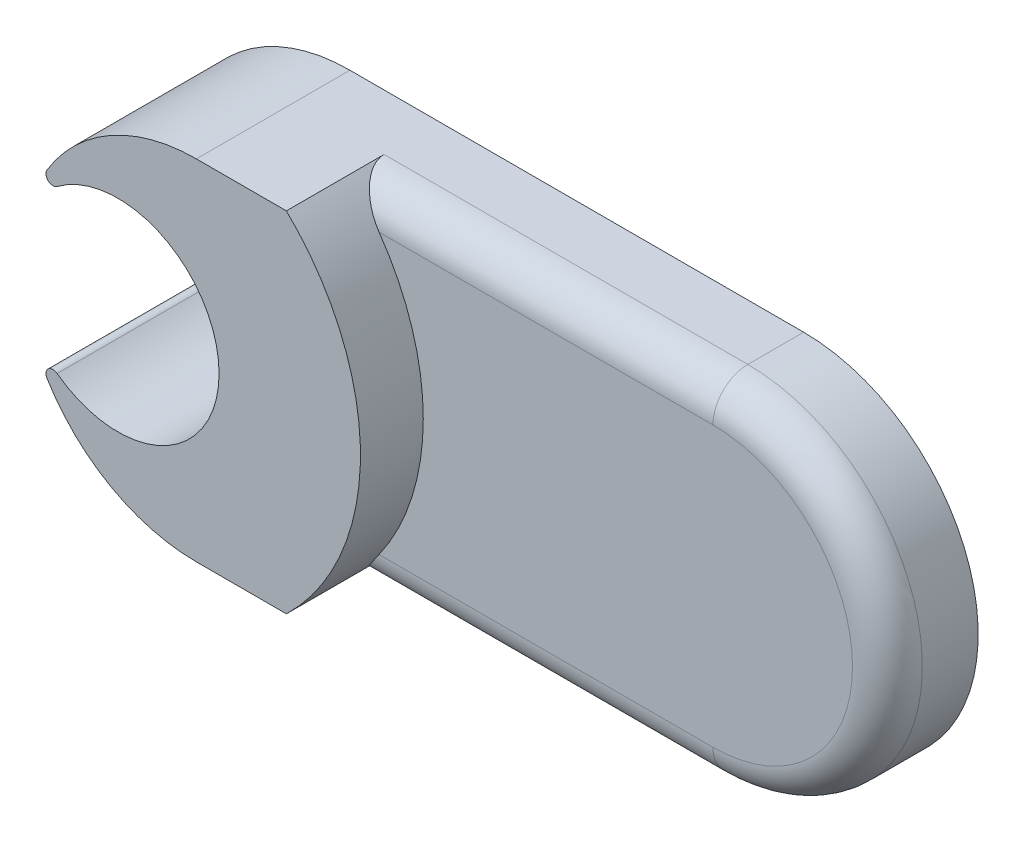
ISO-10303-21;
HEADER;
FILE_DESCRIPTION(('STEP AP214'),'2;1');
FILE_NAME('part.step','',(''),(''),'','','');
FILE_SCHEMA(('AUTOMOTIVE_DESIGN { 1 0 10303 214 1 1 1 1 }'));
ENDSEC;
DATA;
#1=APPLICATION_CONTEXT('core data for automotive mechanical design processes');
#2=APPLICATION_PROTOCOL_DEFINITION('international standard','automotive_design',2000,#1);
#3=PRODUCT_CONTEXT('',#1,'mechanical');
#4=PRODUCT('Part','Part','',(#3));
#5=PRODUCT_RELATED_PRODUCT_CATEGORY('part','',(#4));
#6=PRODUCT_DEFINITION_FORMATION('','',#4);
#7=PRODUCT_DEFINITION_CONTEXT('part definition',#1,'design');
#8=PRODUCT_DEFINITION('design','',#6,#7);
#9=PRODUCT_DEFINITION_SHAPE('','',#8);
#10=(LENGTH_UNIT() NAMED_UNIT(*) SI_UNIT(.MILLI.,.METRE.));
#11=(NAMED_UNIT(*) PLANE_ANGLE_UNIT() SI_UNIT($,.RADIAN.));
#12=(NAMED_UNIT(*) SI_UNIT($,.STERADIAN.) SOLID_ANGLE_UNIT());
#13=UNCERTAINTY_MEASURE_WITH_UNIT(LENGTH_MEASURE(1.E-05),#10,'distance_accuracy_value','');
#14=(GEOMETRIC_REPRESENTATION_CONTEXT(3) GLOBAL_UNCERTAINTY_ASSIGNED_CONTEXT((#13)) GLOBAL_UNIT_ASSIGNED_CONTEXT((#10,
#11,#12)) REPRESENTATION_CONTEXT('',''));
#15=CARTESIAN_POINT('',(0.,0.,0.));
#16=DIRECTION('',(0.,0.,1.));
#17=DIRECTION('',(1.,0.,0.));
#18=AXIS2_PLACEMENT_3D('',#15,#16,#17);
#19=CARTESIAN_POINT('',(-6.9508961068483,0.,2.5));
#20=DIRECTION('',(0.,0.,-1.));
#21=DIRECTION('',(-1.,0.,0.));
#22=AXIS2_PLACEMENT_3D('',#19,#20,#21);
#23=CYLINDRICAL_SURFACE('',#22,6.9508961068483);
#24=DIRECTION('',(0.,0.,-1.));
#25=VECTOR('',#24,1.);
#26=CARTESIAN_POINT('',(-2.12233972960687,-5.,4.4));
#27=LINE('',#26,#25);
#28=CARTESIAN_POINT('',(-2.12233972960687,-5.,4.4));
#29=VERTEX_POINT('',#28);
#30=CARTESIAN_POINT('',(-2.12233972960687,-5.,1.6));
#31=VERTEX_POINT('',#30);
#32=EDGE_CURVE('E166',#29,#31,#27,.T.);
#33=ORIENTED_EDGE('',*,*,#32,.T.);
#34=CARTESIAN_POINT('',(-2.12233972960687,-5.,1.6));
#35=CARTESIAN_POINT('',(-2.12234457520104,-5.00000345143471,1.62260305507743));
#36=CARTESIAN_POINT('',(-2.12154542028916,-4.99923301909382,1.64519116508475));
#37=CARTESIAN_POINT('',(-2.11839010934046,-4.99618353928606,1.69013348630017));
#38=CARTESIAN_POINT('',(-2.1160355263089,-4.99390601593713,1.71248791065789));
#39=CARTESIAN_POINT('',(-2.10677922279317,-4.98493371895246,1.77848805589765));
#40=CARTESIAN_POINT('',(-2.09768255426194,-4.97609730957995,1.82156320865865));
#41=CARTESIAN_POINT('',(-2.07453996522156,-4.95341931342349,1.90471197675535));
#42=CARTESIAN_POINT('',(-2.06051230506074,-4.93959618844959,1.94479601367615));
#43=CARTESIAN_POINT('',(-2.02851653509707,-4.90771317694456,2.0216556330763));
#44=CARTESIAN_POINT('',(-2.01053760962101,-4.88964165175073,2.0584217360257));
#45=CARTESIAN_POINT('',(-1.96260116938497,-4.84081695601622,2.14450433511419));
#46=CARTESIAN_POINT('',(-1.93095281683999,-4.80806713470202,2.19174497600983));
#47=CARTESIAN_POINT('',(-1.86367139637167,-4.73682583609211,2.27841475647069));
#48=CARTESIAN_POINT('',(-1.82803005474442,-4.69832237973206,2.31782718918622));
#49=CARTESIAN_POINT('',(-1.74387253635052,-4.60508806083375,2.39919658422165));
#50=CARTESIAN_POINT('',(-1.69459056710945,-4.54886643108725,2.43865459871866));
#51=CARTESIAN_POINT('',(-1.59460070257519,-4.43069524810547,2.50503657741069));
#52=CARTESIAN_POINT('',(-1.54389308779087,-4.36874681625809,2.53196298926357));
#53=CARTESIAN_POINT('',(-1.45485565617605,-4.25586067911789,2.56806964621902));
#54=CARTESIAN_POINT('',(-1.41646067707239,-4.20582472984825,2.57995178560192));
#55=CARTESIAN_POINT('',(-1.34056384816698,-4.1040476930174,2.59589718131752));
#56=CARTESIAN_POINT('',(-1.30306020259977,-4.05231064344712,2.59997776113244));
#57=CARTESIAN_POINT('',(-1.26627152045749,-4.,2.6));
#58=B_SPLINE_CURVE_WITH_KNOTS('',3,(#34,#35,#36,#37,#38,#39,#40,#41,#42,#43,#44,#45,#46,#47,#48,
#49,#50,#51,#52,#53,#54,#55,#56,#57),.UNSPECIFIED.,.F.,.F.,(4,2,2,2,2,2,2,2,2,2,2,4),(0.,
0.067754055372343,0.135439695715017,0.269357496309541,0.402784510823149,0.536581403506004,
0.732358453619885,0.928548941850454,1.18087838875171,1.43315853025771,1.62521481007222,
1.8168441284109),.UNSPECIFIED.);
#59=CARTESIAN_POINT('',(-1.26627152045749,-4.,2.6));
#60=VERTEX_POINT('',#59);
#61=EDGE_CURVE('E45',#31,#60,#58,.T.);
#62=ORIENTED_EDGE('',*,*,#61,.T.);
#63=CARTESIAN_POINT('',(-6.9508961068483,0.,2.6));
#64=DIRECTION('',(0.,0.,1.));
#65=DIRECTION('',(1.,0.,0.));
#66=AXIS2_PLACEMENT_3D('',#63,#64,#65);
#67=CIRCLE('',#66,6.9508961068483);
#68=CARTESIAN_POINT('',(-1.26627152045749,4.,2.6));
#69=VERTEX_POINT('',#68);
#70=EDGE_CURVE('E153',#60,#69,#67,.T.);
#71=ORIENTED_EDGE('',*,*,#70,.T.);
#72=CARTESIAN_POINT('',(-1.26627152045749,4.,2.6));
#73=CARTESIAN_POINT('',(-1.29065365580447,4.03465424319133,2.59999459870398));
#74=CARTESIAN_POINT('',(-1.31533982178584,4.06905967237319,2.59819876345453));
#75=CARTESIAN_POINT('',(-1.36515441438362,4.13717566756535,2.59113956475497));
#76=CARTESIAN_POINT('',(-1.39028272429278,4.17088641198968,2.58587710337003));
#77=CARTESIAN_POINT('',(-1.46632059929013,4.27099613812749,2.56499812741862));
#78=CARTESIAN_POINT('',(-1.51766915361528,4.33606913174294,2.54429189665593));
#79=CARTESIAN_POINT('',(-1.62055205717989,4.46196291958184,2.48959637901154));
#80=CARTESIAN_POINT('',(-1.6720777900635,4.52270597916737,2.4554139147823));
#81=CARTESIAN_POINT('',(-1.77237074852416,4.63719523092275,2.37388938089479));
#82=CARTESIAN_POINT('',(-1.82114379743308,4.69095653283777,2.32657644884274));
#83=CARTESIAN_POINT('',(-1.8971919055603,4.77252782110355,2.23681184457826));
#84=CARTESIAN_POINT('',(-1.92614936979382,4.80295666878988,2.19815031548391));
#85=CARTESIAN_POINT('',(-1.98008219707271,4.85875095210995,2.11483117934877));
#86=CARTESIAN_POINT('',(-2.00506361717802,4.88412410467953,2.07018288743272));
#87=CARTESIAN_POINT('',(-2.04455566757881,4.92375822027316,1.98520233153804));
#88=CARTESIAN_POINT('',(-2.06016341442494,4.93923433010912,1.9459513029763));
#89=CARTESIAN_POINT('',(-2.08668313484873,4.96535358810477,1.86441326363169));
#90=CARTESIAN_POINT('',(-2.09760675978786,4.97600873170258,1.82213409475687));
#91=CARTESIAN_POINT('',(-2.1111461315003,4.98917198133805,1.74971584603225));
#92=CARTESIAN_POINT('',(-2.11531103556847,4.9932053650788,1.72013497516519));
#93=CARTESIAN_POINT('',(-2.12092256469875,4.99863147161458,1.66038116473219));
#94=CARTESIAN_POINT('',(-2.12236016258594,5.00001542513523,1.63020659181393));
#95=CARTESIAN_POINT('',(-2.12233972960687,5.,1.6));
#96=B_SPLINE_CURVE_WITH_KNOTS('',3,(#72,#73,#74,#75,#76,#77,#78,#79,#80,#81,#82,#83,#84,#85,#86,
#87,#88,#89,#90,#91,#92,#93,#94,#95),.UNSPECIFIED.,.F.,.F.,(4,2,2,2,2,2,2,2,2,2,2,4),(0.,
0.127025424982204,0.254017809201891,0.509102917246378,0.767985909533948,1.02629895017916,
1.19703570130071,1.36750981168876,1.50196544846849,1.63608467021841,1.7262851678419,
1.81678370483598),.UNSPECIFIED.);
#97=CARTESIAN_POINT('',(-2.12233972960687,5.,1.6));
#98=VERTEX_POINT('',#97);
#99=EDGE_CURVE('E11',#69,#98,#96,.T.);
#100=ORIENTED_EDGE('',*,*,#99,.T.);
#101=DIRECTION('',(0.,0.,-1.));
#102=VECTOR('',#101,1.);
#103=CARTESIAN_POINT('',(-2.12233972960687,5.,2.5));
#104=LINE('',#103,#102);
#105=CARTESIAN_POINT('',(-2.12233972960687,5.,4.4));
#106=VERTEX_POINT('',#105);
#107=EDGE_CURVE('E53',#106,#98,#104,.T.);
#108=ORIENTED_EDGE('',*,*,#107,.F.);
#109=CARTESIAN_POINT('',(-6.9508961068483,0.,4.4));
#110=DIRECTION('',(0.,0.,1.));
#111=DIRECTION('',(1.,0.,0.));
#112=AXIS2_PLACEMENT_3D('',#109,#110,#111);
#113=CIRCLE('',#112,6.9508961068483);
#114=EDGE_CURVE('E162',#29,#106,#113,.T.);
#115=ORIENTED_EDGE('',*,*,#114,.F.);
#116=EDGE_LOOP('',(#33,#62,#71,#100,#108,#115));
#117=FACE_BOUND('',#116,.T.);
#118=ADVANCED_FACE('F35',(#117),#23,.T.);
#119=CARTESIAN_POINT('',(0.,5.,2.5));
#120=DIRECTION('',(0.,1.,0.));
#121=DIRECTION('',(-1.,0.,0.));
#122=AXIS2_PLACEMENT_3D('',#119,#120,#121);
#123=PLANE('',#122);
#124=ORIENTED_EDGE('',*,*,#107,.T.);
#125=DIRECTION('',(1.,0.,0.));
#126=VECTOR('',#125,1.);
#127=CARTESIAN_POINT('',(0.,5.,1.6));
#128=LINE('',#127,#126);
#129=CARTESIAN_POINT('',(8.2991038931517,5.,1.6));
#130=VERTEX_POINT('',#129);
#131=EDGE_CURVE('E57',#98,#130,#128,.T.);
#132=ORIENTED_EDGE('',*,*,#131,.T.);
#133=DIRECTION('',(0.,0.,-1.));
#134=VECTOR('',#133,1.);
#135=CARTESIAN_POINT('',(8.2991038931517,5.,2.6));
#136=LINE('',#135,#134);
#137=CARTESIAN_POINT('',(8.2991038931517,5.,0.));
#138=VERTEX_POINT('',#137);
#139=EDGE_CURVE('E136',#130,#138,#136,.T.);
#140=ORIENTED_EDGE('',*,*,#139,.T.);
#141=DIRECTION('',(1.,0.,0.));
#142=VECTOR('',#141,1.);
#143=CARTESIAN_POINT('',(0.,5.,0.));
#144=LINE('',#143,#142);
#145=CARTESIAN_POINT('',(-4.7008961068483,5.,0.));
#146=VERTEX_POINT('',#145);
#147=EDGE_CURVE('E152',#146,#138,#144,.T.);
#148=ORIENTED_EDGE('',*,*,#147,.F.);
#149=DIRECTION('',(0.,0.,-1.));
#150=VECTOR('',#149,1.);
#151=CARTESIAN_POINT('',(-4.7008961068483,5.,2.5));
#152=LINE('',#151,#150);
#153=CARTESIAN_POINT('',(-4.7008961068483,5.,4.4));
#154=VERTEX_POINT('',#153);
#155=EDGE_CURVE('E186',#154,#146,#152,.T.);
#156=ORIENTED_EDGE('',*,*,#155,.F.);
#157=DIRECTION('',(1.,0.,0.));
#158=VECTOR('',#157,1.);
#159=CARTESIAN_POINT('',(0.,5.,4.4));
#160=LINE('',#159,#158);
#161=EDGE_CURVE('E165',#154,#106,#160,.T.);
#162=ORIENTED_EDGE('',*,*,#161,.T.);
#163=EDGE_LOOP('',(#124,#132,#140,#148,#156,#162));
#164=FACE_BOUND('',#163,.T.);
#165=ADVANCED_FACE('F245',(#164),#123,.T.);
#166=CARTESIAN_POINT('',(-4.7008961068483,0.,2.5));
#167=DIRECTION('',(0.,0.,-1.));
#168=DIRECTION('',(-1.,0.,0.));
#169=AXIS2_PLACEMENT_3D('',#166,#167,#168);
#170=CYLINDRICAL_SURFACE('',#169,5.);
#171=CARTESIAN_POINT('',(-4.7008961068483,0.,0.));
#172=DIRECTION('',(0.,0.,1.));
#173=DIRECTION('',(1.,0.,0.));
#174=AXIS2_PLACEMENT_3D('',#171,#172,#173);
#175=CIRCLE('',#174,5.);
#176=CARTESIAN_POINT('',(-8.9815674031446,2.58376725984848,0.));
#177=VERTEX_POINT('',#176);
#178=EDGE_CURVE('E184',#146,#177,#175,.T.);
#179=ORIENTED_EDGE('',*,*,#178,.T.);
#180=DIRECTION('',(0.,0.,-1.));
#181=VECTOR('',#180,1.);
#182=CARTESIAN_POINT('',(-8.9815674031446,2.58376725984848,2.5));
#183=LINE('',#182,#181);
#184=CARTESIAN_POINT('',(-8.9815674031446,2.58376725984848,4.4));
#185=VERTEX_POINT('',#184);
#186=EDGE_CURVE('E204',#177,#185,#183,.F.);
#187=ORIENTED_EDGE('',*,*,#186,.T.);
#188=CARTESIAN_POINT('',(-4.7008961068483,0.,4.4));
#189=DIRECTION('',(0.,0.,1.));
#190=DIRECTION('',(1.,0.,0.));
#191=AXIS2_PLACEMENT_3D('',#188,#189,#190);
#192=CIRCLE('',#191,5.);
#193=EDGE_CURVE('E171',#154,#185,#192,.T.);
#194=ORIENTED_EDGE('',*,*,#193,.F.);
#195=ORIENTED_EDGE('',*,*,#155,.T.);
#196=EDGE_LOOP('',(#179,#187,#194,#195));
#197=FACE_BOUND('',#196,.T.);
#198=ADVANCED_FACE('F250',(#197),#170,.T.);
#199=CARTESIAN_POINT('',(0.,0.,0.));
#200=DIRECTION('',(0.,0.,1.));
#201=DIRECTION('',(1.,0.,0.));
#202=AXIS2_PLACEMENT_3D('',#199,#200,#201);
#203=PLANE('',#202);
#204=ORIENTED_EDGE('',*,*,#147,.T.);
#205=CARTESIAN_POINT('',(8.2991038931517,0.,0.));
#206=DIRECTION('',(0.,0.,1.));
#207=DIRECTION('',(1.,0.,0.));
#208=AXIS2_PLACEMENT_3D('',#205,#206,#207);
#209=CIRCLE('',#208,5.);
#210=CARTESIAN_POINT('',(8.2991038931517,-5.,0.));
#211=VERTEX_POINT('',#210);
#212=EDGE_CURVE('E129',#211,#138,#209,.T.);
#213=ORIENTED_EDGE('',*,*,#212,.F.);
#214=DIRECTION('',(1.,0.,0.));
#215=VECTOR('',#214,1.);
#216=CARTESIAN_POINT('',(0.,-5.,0.));
#217=LINE('',#216,#215);
#218=CARTESIAN_POINT('',(-4.7008961068483,-5.,0.));
#219=VERTEX_POINT('',#218);
#220=EDGE_CURVE('E135',#219,#211,#217,.T.);
#221=ORIENTED_EDGE('',*,*,#220,.F.);
#222=CARTESIAN_POINT('',(-4.7008961068483,0.,0.));
#223=DIRECTION('',(0.,0.,1.));
#224=DIRECTION('',(1.,0.,0.));
#225=AXIS2_PLACEMENT_3D('',#222,#223,#224);
#226=CIRCLE('',#225,5.);
#227=CARTESIAN_POINT('',(-8.9815674031446,-2.58376725984849,0.));
#228=VERTEX_POINT('',#227);
#229=EDGE_CURVE('E175',#228,#219,#226,.T.);
#230=ORIENTED_EDGE('',*,*,#229,.F.);
#231=CARTESIAN_POINT('',(-8.81034055129275,-2.48041656945455,0.));
#232=DIRECTION('',(0.,0.,1.));
#233=DIRECTION('',(1.,0.,0.));
#234=AXIS2_PLACEMENT_3D('',#231,#232,#233);
#235=CIRCLE('',#234,0.2);
#236=CARTESIAN_POINT('',(-8.69037639358666,-2.32038969400587,0.));
#237=VERTEX_POINT('',#236);
#238=EDGE_CURVE('E192',#228,#237,#235,.F.);
#239=ORIENTED_EDGE('',*,*,#238,.T.);
#240=CARTESIAN_POINT('',(-6.9508961068483,0.,0.));
#241=DIRECTION('',(0.,0.,1.));
#242=DIRECTION('',(1.,0.,0.));
#243=AXIS2_PLACEMENT_3D('',#240,#241,#242);
#244=CIRCLE('',#243,2.9);
#245=CARTESIAN_POINT('',(-8.69037639358666,2.32038969400586,0.));
#246=VERTEX_POINT('',#245);
#247=EDGE_CURVE('E170',#237,#246,#244,.T.);
#248=ORIENTED_EDGE('',*,*,#247,.T.);
#249=CARTESIAN_POINT('',(-8.81034055129275,2.48041656945454,0.));
#250=DIRECTION('',(0.,0.,1.));
#251=DIRECTION('',(1.,0.,0.));
#252=AXIS2_PLACEMENT_3D('',#249,#250,#251);
#253=CIRCLE('',#252,0.2);
#254=EDGE_CURVE('E201',#246,#177,#253,.F.);
#255=ORIENTED_EDGE('',*,*,#254,.T.);
#256=ORIENTED_EDGE('',*,*,#178,.F.);
#257=EDGE_LOOP('',(#204,#213,#221,#230,#239,#248,#255,#256));
#258=FACE_BOUND('',#257,.T.);
#259=ADVANCED_FACE('F149',(#258),#203,.F.);
#260=CARTESIAN_POINT('',(-6.9508961068483,0.,4.4));
#261=DIRECTION('',(0.,0.,-1.));
#262=DIRECTION('',(-1.,0.,0.));
#263=AXIS2_PLACEMENT_3D('',#260,#261,#262);
#264=CYLINDRICAL_SURFACE('',#263,2.9);
#265=CARTESIAN_POINT('',(-6.9508961068483,0.,4.4));
#266=DIRECTION('',(0.,0.,1.));
#267=DIRECTION('',(1.,0.,0.));
#268=AXIS2_PLACEMENT_3D('',#265,#266,#267);
#269=CIRCLE('',#268,2.9);
#270=CARTESIAN_POINT('',(-8.69037639358666,-2.32038969400587,4.4));
#271=VERTEX_POINT('',#270);
#272=CARTESIAN_POINT('',(-8.69037639358666,2.32038969400586,4.4));
#273=VERTEX_POINT('',#272);
#274=EDGE_CURVE('E174',#271,#273,#269,.T.);
#275=ORIENTED_EDGE('',*,*,#274,.T.);
#276=DIRECTION('',(0.,0.,-1.));
#277=VECTOR('',#276,1.);
#278=CARTESIAN_POINT('',(-8.69037639358666,2.32038969400586,4.4));
#279=LINE('',#278,#277);
#280=EDGE_CURVE('E198',#273,#246,#279,.T.);
#281=ORIENTED_EDGE('',*,*,#280,.T.);
#282=ORIENTED_EDGE('',*,*,#247,.F.);
#283=DIRECTION('',(0.,0.,-1.));
#284=VECTOR('',#283,1.);
#285=CARTESIAN_POINT('',(-8.69037639358666,-2.32038969400587,4.4));
#286=LINE('',#285,#284);
#287=EDGE_CURVE('E194',#237,#271,#286,.F.);
#288=ORIENTED_EDGE('',*,*,#287,.T.);
#289=EDGE_LOOP('',(#275,#281,#282,#288));
#290=FACE_BOUND('',#289,.T.);
#291=ADVANCED_FACE('F274',(#290),#264,.F.);
#292=CARTESIAN_POINT('',(-4.7008961068483,0.,4.4));
#293=DIRECTION('',(0.,0.,-1.));
#294=DIRECTION('',(-1.,0.,0.));
#295=AXIS2_PLACEMENT_3D('',#292,#293,#294);
#296=CYLINDRICAL_SURFACE('',#295,5.);
#297=CARTESIAN_POINT('',(-4.7008961068483,0.,4.4));
#298=DIRECTION('',(0.,0.,1.));
#299=DIRECTION('',(1.,0.,0.));
#300=AXIS2_PLACEMENT_3D('',#297,#298,#299);
#301=CIRCLE('',#300,5.);
#302=CARTESIAN_POINT('',(-8.9815674031446,-2.58376725984849,4.4));
#303=VERTEX_POINT('',#302);
#304=CARTESIAN_POINT('',(-4.7008961068483,-5.,4.4));
#305=VERTEX_POINT('',#304);
#306=EDGE_CURVE('E178',#303,#305,#301,.T.);
#307=ORIENTED_EDGE('',*,*,#306,.F.);
#308=DIRECTION('',(0.,0.,-1.));
#309=VECTOR('',#308,1.);
#310=CARTESIAN_POINT('',(-8.9815674031446,-2.58376725984849,4.4));
#311=LINE('',#310,#309);
#312=EDGE_CURVE('E189',#303,#228,#311,.T.);
#313=ORIENTED_EDGE('',*,*,#312,.T.);
#314=ORIENTED_EDGE('',*,*,#229,.T.);
#315=DIRECTION('',(0.,0.,-1.));
#316=VECTOR('',#315,1.);
#317=CARTESIAN_POINT('',(-4.7008961068483,-5.,4.4));
#318=LINE('',#317,#316);
#319=EDGE_CURVE('E143',#305,#219,#318,.T.);
#320=ORIENTED_EDGE('',*,*,#319,.F.);
#321=EDGE_LOOP('',(#307,#313,#314,#320));
#322=FACE_BOUND('',#321,.T.);
#323=ADVANCED_FACE('F282',(#322),#296,.T.);
#324=CARTESIAN_POINT('',(0.,0.,4.4));
#325=DIRECTION('',(0.,0.,1.));
#326=DIRECTION('',(1.,0.,0.));
#327=AXIS2_PLACEMENT_3D('',#324,#325,#326);
#328=PLANE('',#327);
#329=ORIENTED_EDGE('',*,*,#193,.T.);
#330=CARTESIAN_POINT('',(-8.81034055129275,2.48041656945454,4.4));
#331=DIRECTION('',(0.,0.,1.));
#332=DIRECTION('',(1.,0.,0.));
#333=AXIS2_PLACEMENT_3D('',#330,#331,#332);
#334=CIRCLE('',#333,0.2);
#335=EDGE_CURVE('E206',#185,#273,#334,.T.);
#336=ORIENTED_EDGE('',*,*,#335,.T.);
#337=ORIENTED_EDGE('',*,*,#274,.F.);
#338=CARTESIAN_POINT('',(-8.81034055129275,-2.48041656945455,4.4));
#339=DIRECTION('',(0.,0.,1.));
#340=DIRECTION('',(1.,0.,0.));
#341=AXIS2_PLACEMENT_3D('',#338,#339,#340);
#342=CIRCLE('',#341,0.2);
#343=EDGE_CURVE('E196',#271,#303,#342,.T.);
#344=ORIENTED_EDGE('',*,*,#343,.T.);
#345=ORIENTED_EDGE('',*,*,#306,.T.);
#346=DIRECTION('',(1.,0.,0.));
#347=VECTOR('',#346,1.);
#348=CARTESIAN_POINT('',(0.,-5.,4.4));
#349=LINE('',#348,#347);
#350=EDGE_CURVE('E146',#305,#29,#349,.T.);
#351=ORIENTED_EDGE('',*,*,#350,.T.);
#352=ORIENTED_EDGE('',*,*,#114,.T.);
#353=ORIENTED_EDGE('',*,*,#161,.F.);
#354=EDGE_LOOP('',(#329,#336,#337,#344,#345,#351,#352,#353));
#355=FACE_BOUND('',#354,.T.);
#356=ADVANCED_FACE('F264',(#355),#328,.T.);
#357=CARTESIAN_POINT('',(-8.81034055129275,-2.48041656945455,4.4));
#358=DIRECTION('',(0.,0.,1.));
#359=DIRECTION('',(1.,0.,0.));
#360=AXIS2_PLACEMENT_3D('',#357,#358,#359);
#361=CYLINDRICAL_SURFACE('',#360,0.2);
#362=ORIENTED_EDGE('',*,*,#343,.F.);
#363=ORIENTED_EDGE('',*,*,#287,.F.);
#364=ORIENTED_EDGE('',*,*,#238,.F.);
#365=ORIENTED_EDGE('',*,*,#312,.F.);
#366=EDGE_LOOP('',(#362,#363,#364,#365));
#367=FACE_BOUND('',#366,.T.);
#368=ADVANCED_FACE('F279',(#367),#361,.T.);
#369=CARTESIAN_POINT('',(-8.81034055129275,2.48041656945454,2.5));
#370=DIRECTION('',(0.,0.,1.));
#371=DIRECTION('',(1.,0.,0.));
#372=AXIS2_PLACEMENT_3D('',#369,#370,#371);
#373=CYLINDRICAL_SURFACE('',#372,0.2);
#374=ORIENTED_EDGE('',*,*,#335,.F.);
#375=ORIENTED_EDGE('',*,*,#186,.F.);
#376=ORIENTED_EDGE('',*,*,#254,.F.);
#377=ORIENTED_EDGE('',*,*,#280,.F.);
#378=EDGE_LOOP('',(#374,#375,#376,#377));
#379=FACE_BOUND('',#378,.T.);
#380=ADVANCED_FACE('F236',(#379),#373,.T.);
#381=CARTESIAN_POINT('',(0.,-5.,4.4));
#382=DIRECTION('',(0.,1.,0.));
#383=DIRECTION('',(0.,0.,1.));
#384=AXIS2_PLACEMENT_3D('',#381,#382,#383);
#385=PLANE('',#384);
#386=DIRECTION('',(0.,0.,-1.));
#387=VECTOR('',#386,1.);
#388=CARTESIAN_POINT('',(8.2991038931517,-5.,2.6));
#389=LINE('',#388,#387);
#390=CARTESIAN_POINT('',(8.2991038931517,-5.,1.6));
#391=VERTEX_POINT('',#390);
#392=EDGE_CURVE('E125',#391,#211,#389,.T.);
#393=ORIENTED_EDGE('',*,*,#392,.F.);
#394=DIRECTION('',(1.,0.,0.));
#395=VECTOR('',#394,1.);
#396=CARTESIAN_POINT('',(-2.12233972960687,-5.,1.6));
#397=LINE('',#396,#395);
#398=EDGE_CURVE('E215',#391,#31,#397,.F.);
#399=ORIENTED_EDGE('',*,*,#398,.T.);
#400=ORIENTED_EDGE('',*,*,#32,.F.);
#401=ORIENTED_EDGE('',*,*,#350,.F.);
#402=ORIENTED_EDGE('',*,*,#319,.T.);
#403=ORIENTED_EDGE('',*,*,#220,.T.);
#404=EDGE_LOOP('',(#393,#399,#400,#401,#402,#403));
#405=FACE_BOUND('',#404,.T.);
#406=ADVANCED_FACE('F140',(#405),#385,.F.);
#407=CARTESIAN_POINT('',(8.2991038931517,0.,2.6));
#408=DIRECTION('',(0.,0.,-1.));
#409=DIRECTION('',(-1.,0.,0.));
#410=AXIS2_PLACEMENT_3D('',#407,#408,#409);
#411=CYLINDRICAL_SURFACE('',#410,5.);
#412=ORIENTED_EDGE('',*,*,#139,.F.);
#413=CARTESIAN_POINT('',(8.2991038931517,0.,1.6));
#414=DIRECTION('',(0.,0.,1.));
#415=DIRECTION('',(1.,0.,0.));
#416=AXIS2_PLACEMENT_3D('',#413,#414,#415);
#417=CIRCLE('',#416,5.);
#418=EDGE_CURVE('E131',#130,#391,#417,.F.);
#419=ORIENTED_EDGE('',*,*,#418,.T.);
#420=ORIENTED_EDGE('',*,*,#392,.T.);
#421=ORIENTED_EDGE('',*,*,#212,.T.);
#422=EDGE_LOOP('',(#412,#419,#420,#421));
#423=FACE_BOUND('',#422,.T.);
#424=ADVANCED_FACE('F127',(#423),#411,.T.);
#425=CARTESIAN_POINT('',(0.,0.,2.6));
#426=DIRECTION('',(0.,0.,1.));
#427=DIRECTION('',(1.,0.,0.));
#428=AXIS2_PLACEMENT_3D('',#425,#426,#427);
#429=PLANE('',#428);
#430=ORIENTED_EDGE('',*,*,#70,.F.);
#431=DIRECTION('',(1.,0.,0.));
#432=VECTOR('',#431,1.);
#433=CARTESIAN_POINT('',(8.2991038931517,-4.,2.6));
#434=LINE('',#433,#432);
#435=CARTESIAN_POINT('',(8.2991038931517,-4.,2.6));
#436=VERTEX_POINT('',#435);
#437=EDGE_CURVE('E212',#60,#436,#434,.T.);
#438=ORIENTED_EDGE('',*,*,#437,.T.);
#439=CARTESIAN_POINT('',(8.2991038931517,0.,2.6));
#440=DIRECTION('',(0.,0.,1.));
#441=DIRECTION('',(1.,0.,0.));
#442=AXIS2_PLACEMENT_3D('',#439,#440,#441);
#443=CIRCLE('',#442,4.);
#444=CARTESIAN_POINT('',(8.2991038931517,4.,2.6));
#445=VERTEX_POINT('',#444);
#446=EDGE_CURVE('E210',#436,#445,#443,.T.);
#447=ORIENTED_EDGE('',*,*,#446,.T.);
#448=DIRECTION('',(1.,0.,0.));
#449=VECTOR('',#448,1.);
#450=CARTESIAN_POINT('',(0.,4.,2.6));
#451=LINE('',#450,#449);
#452=EDGE_CURVE('E208',#445,#69,#451,.F.);
#453=ORIENTED_EDGE('',*,*,#452,.T.);
#454=EDGE_LOOP('',(#430,#438,#447,#453));
#455=FACE_BOUND('',#454,.T.);
#456=ADVANCED_FACE('F242',(#455),#429,.T.);
#457=CARTESIAN_POINT('',(0.,4.,1.6));
#458=DIRECTION('',(1.,0.,0.));
#459=DIRECTION('',(0.,1.,0.));
#460=AXIS2_PLACEMENT_3D('',#457,#458,#459);
#461=CYLINDRICAL_SURFACE('',#460,1.);
#462=ORIENTED_EDGE('',*,*,#99,.F.);
#463=ORIENTED_EDGE('',*,*,#452,.F.);
#464=CARTESIAN_POINT('',(8.2991038931517,4.,1.6));
#465=DIRECTION('',(1.,0.,0.));
#466=DIRECTION('',(0.,0.,-1.));
#467=AXIS2_PLACEMENT_3D('',#464,#465,#466);
#468=CIRCLE('',#467,1.);
#469=EDGE_CURVE('E40',#130,#445,#468,.T.);
#470=ORIENTED_EDGE('',*,*,#469,.F.);
#471=ORIENTED_EDGE('',*,*,#131,.F.);
#472=EDGE_LOOP('',(#462,#463,#470,#471));
#473=FACE_BOUND('',#472,.T.);
#474=ADVANCED_FACE('F37',(#473),#461,.T.);
#475=CARTESIAN_POINT('',(8.2991038931517,0.,1.6));
#476=DIRECTION('',(0.,0.,1.));
#477=DIRECTION('',(1.,0.,0.));
#478=AXIS2_PLACEMENT_3D('',#475,#476,#477);
#479=TOROIDAL_SURFACE('',#478,4.,1.);
#480=ORIENTED_EDGE('',*,*,#469,.T.);
#481=ORIENTED_EDGE('',*,*,#446,.F.);
#482=CARTESIAN_POINT('',(8.2991038931517,-4.,1.6));
#483=DIRECTION('',(-1.,0.,0.));
#484=DIRECTION('',(0.,0.,1.));
#485=AXIS2_PLACEMENT_3D('',#482,#483,#484);
#486=CIRCLE('',#485,1.);
#487=EDGE_CURVE('E158',#391,#436,#486,.T.);
#488=ORIENTED_EDGE('',*,*,#487,.F.);
#489=ORIENTED_EDGE('',*,*,#418,.F.);
#490=EDGE_LOOP('',(#480,#481,#488,#489));
#491=FACE_BOUND('',#490,.T.);
#492=ADVANCED_FACE('F234',(#491),#479,.T.);
#493=CARTESIAN_POINT('',(0.,-4.,1.6));
#494=DIRECTION('',(-1.,0.,0.));
#495=DIRECTION('',(0.,0.,1.));
#496=AXIS2_PLACEMENT_3D('',#493,#494,#495);
#497=CYLINDRICAL_SURFACE('',#496,1.);
#498=ORIENTED_EDGE('',*,*,#61,.F.);
#499=ORIENTED_EDGE('',*,*,#398,.F.);
#500=ORIENTED_EDGE('',*,*,#487,.T.);
#501=ORIENTED_EDGE('',*,*,#437,.F.);
#502=EDGE_LOOP('',(#498,#499,#500,#501));
#503=FACE_BOUND('',#502,.T.);
#504=ADVANCED_FACE('F230',(#503),#497,.T.);
#505=CLOSED_SHELL('',(#118,#165,#198,#259,#291,#323,#356,#368,#380,#406,#424,#456,#474,#492,#504));
#506=MANIFOLD_SOLID_BREP('B2',#505);
#507=ADVANCED_BREP_SHAPE_REPRESENTATION('',(#18,#506),#14);
#508=SHAPE_DEFINITION_REPRESENTATION(#9,#507);
ENDSEC;
END-ISO-10303-21;
